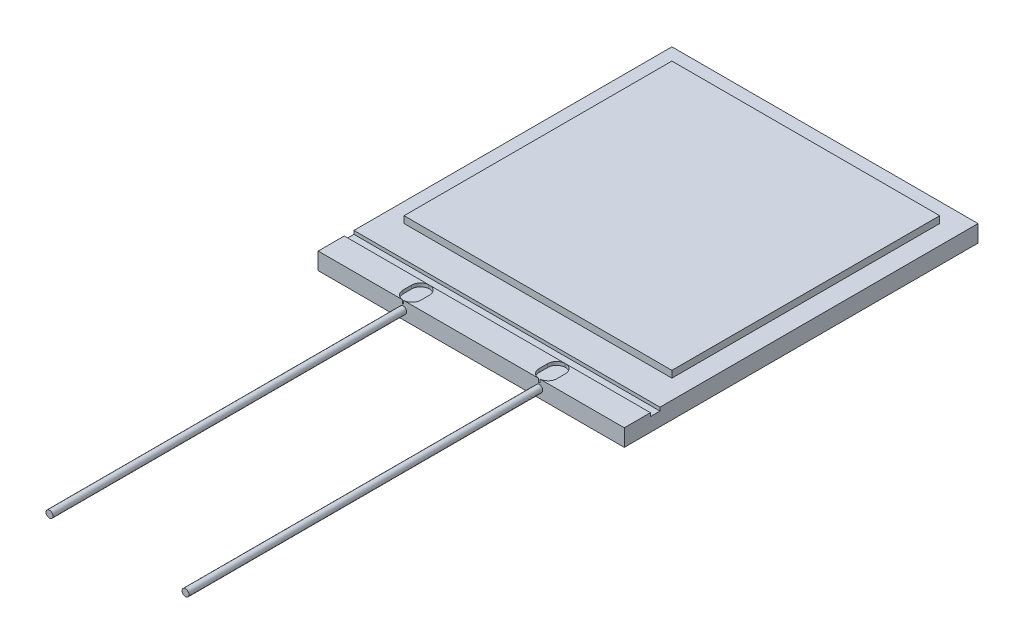
ISO-10303-21;
HEADER;
FILE_DESCRIPTION(('STEP AP214'),'2;1');
FILE_NAME('part.step','',(''),(''),'','','');
FILE_SCHEMA(('AUTOMOTIVE_DESIGN { 1 0 10303 214 1 1 1 1 }'));
ENDSEC;
DATA;
#1=APPLICATION_CONTEXT('core data for automotive mechanical design processes');
#2=APPLICATION_PROTOCOL_DEFINITION('international standard','automotive_design',2000,#1);
#3=PRODUCT_CONTEXT('',#1,'mechanical');
#4=PRODUCT('Part','Part','',(#3));
#5=PRODUCT_RELATED_PRODUCT_CATEGORY('part','',(#4));
#6=PRODUCT_DEFINITION_FORMATION('','',#4);
#7=PRODUCT_DEFINITION_CONTEXT('part definition',#1,'design');
#8=PRODUCT_DEFINITION('design','',#6,#7);
#9=PRODUCT_DEFINITION_SHAPE('','',#8);
#10=(LENGTH_UNIT() NAMED_UNIT(*) SI_UNIT(.MILLI.,.METRE.));
#11=(NAMED_UNIT(*) PLANE_ANGLE_UNIT() SI_UNIT($,.RADIAN.));
#12=(NAMED_UNIT(*) SI_UNIT($,.STERADIAN.) SOLID_ANGLE_UNIT());
#13=UNCERTAINTY_MEASURE_WITH_UNIT(LENGTH_MEASURE(1.E-05),#10,'distance_accuracy_value','');
#14=(GEOMETRIC_REPRESENTATION_CONTEXT(3) GLOBAL_UNCERTAINTY_ASSIGNED_CONTEXT((#13)) GLOBAL_UNIT_ASSIGNED_CONTEXT((#10,
#11,#12)) REPRESENTATION_CONTEXT('',''));
#15=CARTESIAN_POINT('',(0.,0.,0.));
#16=DIRECTION('',(0.,0.,1.));
#17=DIRECTION('',(1.,0.,0.));
#18=AXIS2_PLACEMENT_3D('',#15,#16,#17);
#19=CARTESIAN_POINT('',(5.715,0.635,6.604));
#20=DIRECTION('',(0.,0.,-1.));
#21=DIRECTION('',(-1.,0.,0.));
#22=AXIS2_PLACEMENT_3D('',#19,#20,#21);
#23=PLANE('',#22);
#24=DIRECTION('',(0.,1.,0.));
#25=VECTOR('',#24,1.);
#26=CARTESIAN_POINT('',(2.56024760363874,0.508,6.604));
#27=LINE('',#26,#25);
#28=CARTESIAN_POINT('',(2.56024760363874,0.508,6.604));
#29=VERTEX_POINT('',#28);
#30=CARTESIAN_POINT('',(2.56024760363874,0.635,6.604));
#31=VERTEX_POINT('',#30);
#32=EDGE_CURVE('E342',#29,#31,#27,.T.);
#33=ORIENTED_EDGE('',*,*,#32,.F.);
#34=DIRECTION('',(1.,0.,0.));
#35=VECTOR('',#34,1.);
#36=CARTESIAN_POINT('',(0.,0.508,6.604));
#37=LINE('',#36,#35);
#38=CARTESIAN_POINT('',(2.51975239636126,0.508,6.604));
#39=VERTEX_POINT('',#38);
#40=EDGE_CURVE('E692',#39,#29,#37,.T.);
#41=ORIENTED_EDGE('',*,*,#40,.F.);
#42=DIRECTION('',(0.,1.,0.));
#43=VECTOR('',#42,1.);
#44=CARTESIAN_POINT('',(2.51975239636126,0.508,6.604));
#45=LINE('',#44,#43);
#46=CARTESIAN_POINT('',(2.51975239636126,0.635,6.604));
#47=VERTEX_POINT('',#46);
#48=EDGE_CURVE('E359',#39,#47,#45,.T.);
#49=ORIENTED_EDGE('',*,*,#48,.T.);
#50=DIRECTION('',(1.,0.,0.));
#51=VECTOR('',#50,1.);
#52=CARTESIAN_POINT('',(5.715,0.635,6.604));
#53=LINE('',#52,#51);
#54=CARTESIAN_POINT('',(-2.51975239636126,0.635,6.604));
#55=VERTEX_POINT('',#54);
#56=EDGE_CURVE('E489',#55,#47,#53,.T.);
#57=ORIENTED_EDGE('',*,*,#56,.F.);
#58=DIRECTION('',(0.,1.,0.));
#59=VECTOR('',#58,1.);
#60=CARTESIAN_POINT('',(-2.51975239636126,0.508,6.604));
#61=LINE('',#60,#59);
#62=CARTESIAN_POINT('',(-2.51975239636126,0.508,6.604));
#63=VERTEX_POINT('',#62);
#64=EDGE_CURVE('E673',#63,#55,#61,.T.);
#65=ORIENTED_EDGE('',*,*,#64,.F.);
#66=DIRECTION('',(1.,0.,0.));
#67=VECTOR('',#66,1.);
#68=CARTESIAN_POINT('',(0.,0.508,6.604));
#69=LINE('',#68,#67);
#70=CARTESIAN_POINT('',(-2.56024760363874,0.508,6.604));
#71=VERTEX_POINT('',#70);
#72=EDGE_CURVE('E529',#71,#63,#69,.T.);
#73=ORIENTED_EDGE('',*,*,#72,.F.);
#74=DIRECTION('',(0.,1.,0.));
#75=VECTOR('',#74,1.);
#76=CARTESIAN_POINT('',(-2.56024760363874,0.508,6.604));
#77=LINE('',#76,#75);
#78=CARTESIAN_POINT('',(-2.56024760363874,0.635,6.604));
#79=VERTEX_POINT('',#78);
#80=EDGE_CURVE('E362',#71,#79,#77,.T.);
#81=ORIENTED_EDGE('',*,*,#80,.T.);
#82=CARTESIAN_POINT('',(-5.715,0.635,6.604));
#83=VERTEX_POINT('',#82);
#84=EDGE_CURVE('E485',#83,#79,#53,.T.);
#85=ORIENTED_EDGE('',*,*,#84,.F.);
#86=DIRECTION('',(0.,-1.,0.));
#87=VECTOR('',#86,1.);
#88=CARTESIAN_POINT('',(-5.715,0.635,6.604));
#89=LINE('',#88,#87);
#90=CARTESIAN_POINT('',(-5.715,0.,6.604));
#91=VERTEX_POINT('',#90);
#92=EDGE_CURVE('E503',#83,#91,#89,.T.);
#93=ORIENTED_EDGE('',*,*,#92,.T.);
#94=DIRECTION('',(1.,0.,0.));
#95=VECTOR('',#94,1.);
#96=CARTESIAN_POINT('',(5.715,0.,6.604));
#97=LINE('',#96,#95);
#98=CARTESIAN_POINT('',(5.715,0.,6.604));
#99=VERTEX_POINT('',#98);
#100=EDGE_CURVE('E500',#91,#99,#97,.T.);
#101=ORIENTED_EDGE('',*,*,#100,.T.);
#102=DIRECTION('',(0.,-1.,0.));
#103=VECTOR('',#102,1.);
#104=CARTESIAN_POINT('',(5.715,0.635,6.604));
#105=LINE('',#104,#103);
#106=CARTESIAN_POINT('',(5.715,0.635,6.604));
#107=VERTEX_POINT('',#106);
#108=EDGE_CURVE('E443',#107,#99,#105,.T.);
#109=ORIENTED_EDGE('',*,*,#108,.F.);
#110=EDGE_CURVE('E345',#31,#107,#53,.T.);
#111=ORIENTED_EDGE('',*,*,#110,.F.);
#112=EDGE_LOOP('',(#33,#41,#49,#57,#65,#73,#81,#85,#93,#101,#109,#111));
#113=FACE_BOUND('',#112,.T.);
#114=CARTESIAN_POINT('',(-2.54,0.3175,6.604));
#115=DIRECTION('',(0.,0.,-1.));
#116=DIRECTION('',(-1.,0.,0.));
#117=AXIS2_PLACEMENT_3D('',#114,#115,#116);
#118=CIRCLE('',#117,0.129854710524441);
#119=CARTESIAN_POINT('',(-2.66985471052444,0.3175,6.604));
#120=VERTEX_POINT('',#119);
#121=EDGE_CURVE('E152',#120,#120,#118,.F.);
#122=ORIENTED_EDGE('',*,*,#121,.F.);
#123=EDGE_LOOP('',(#122));
#124=FACE_BOUND('',#123,.T.);
#125=CARTESIAN_POINT('',(2.54,0.3175,6.604));
#126=DIRECTION('',(0.,0.,-1.));
#127=DIRECTION('',(-1.,0.,0.));
#128=AXIS2_PLACEMENT_3D('',#125,#126,#127);
#129=CIRCLE('',#128,0.129854710524441);
#130=CARTESIAN_POINT('',(2.41014528947556,0.3175,6.604));
#131=VERTEX_POINT('',#130);
#132=EDGE_CURVE('E13',#131,#131,#129,.F.);
#133=ORIENTED_EDGE('',*,*,#132,.F.);
#134=EDGE_LOOP('',(#133));
#135=FACE_BOUND('',#134,.T.);
#136=ADVANCED_FACE('F143',(#113,#124,#135),#23,.F.);
#137=CARTESIAN_POINT('',(-5.715,0.635,-6.604));
#138=DIRECTION('',(0.,1.,0.));
#139=DIRECTION('',(0.,0.,1.));
#140=AXIS2_PLACEMENT_3D('',#137,#138,#139);
#141=PLANE('',#140);
#142=DIRECTION('',(1.,0.,0.));
#143=VECTOR('',#142,1.);
#144=CARTESIAN_POINT('',(0.,0.635,5.62864));
#145=LINE('',#144,#143);
#146=CARTESIAN_POINT('',(2.56511819770642,0.635,5.62864));
#147=VERTEX_POINT('',#146);
#148=CARTESIAN_POINT('',(5.715,0.635,5.62864));
#149=VERTEX_POINT('',#148);
#150=EDGE_CURVE('E381',#147,#149,#145,.T.);
#151=ORIENTED_EDGE('',*,*,#150,.F.);
#152=CARTESIAN_POINT('',(2.54,0.635,5.95788324768168));
#153=DIRECTION('',(0.,1.,0.));
#154=DIRECTION('',(0.,0.,1.));
#155=AXIS2_PLACEMENT_3D('',#152,#153,#154);
#156=CIRCLE('',#155,0.3302);
#157=CARTESIAN_POINT('',(2.8702,0.635,5.95788324768168));
#158=VERTEX_POINT('',#157);
#159=EDGE_CURVE('E346',#147,#158,#156,.F.);
#160=ORIENTED_EDGE('',*,*,#159,.T.);
#161=DIRECTION('',(0.,0.,-1.));
#162=VECTOR('',#161,1.);
#163=CARTESIAN_POINT('',(2.8702,0.635,0.));
#164=LINE('',#163,#162);
#165=CARTESIAN_POINT('',(2.8702,0.635,6.27442136818827));
#166=VERTEX_POINT('',#165);
#167=EDGE_CURVE('E330',#166,#158,#164,.T.);
#168=ORIENTED_EDGE('',*,*,#167,.F.);
#169=CARTESIAN_POINT('',(2.54,0.635,6.27442136818827));
#170=DIRECTION('',(0.,1.,0.));
#171=DIRECTION('',(0.,0.,1.));
#172=AXIS2_PLACEMENT_3D('',#169,#170,#171);
#173=CIRCLE('',#172,0.3302);
#174=EDGE_CURVE('E339',#166,#31,#173,.F.);
#175=ORIENTED_EDGE('',*,*,#174,.T.);
#176=ORIENTED_EDGE('',*,*,#110,.T.);
#177=DIRECTION('',(0.,0.,-1.));
#178=VECTOR('',#177,1.);
#179=CARTESIAN_POINT('',(5.715,0.635,6.604));
#180=LINE('',#179,#178);
#181=EDGE_CURVE('E490',#107,#149,#180,.T.);
#182=ORIENTED_EDGE('',*,*,#181,.T.);
#183=EDGE_LOOP('',(#151,#160,#168,#175,#176,#182));
#184=FACE_BOUND('',#183,.T.);
#185=ADVANCED_FACE('F350',(#184),#141,.T.);
#186=DIRECTION('',(0.,0.,-1.));
#187=VECTOR('',#186,1.);
#188=CARTESIAN_POINT('',(2.2098,0.635,0.));
#189=LINE('',#188,#187);
#190=CARTESIAN_POINT('',(2.2098,0.635,6.27442136818827));
#191=VERTEX_POINT('',#190);
#192=CARTESIAN_POINT('',(2.2098,0.635,5.95788324768168));
#193=VERTEX_POINT('',#192);
#194=EDGE_CURVE('E493',#191,#193,#189,.T.);
#195=ORIENTED_EDGE('',*,*,#194,.T.);
#196=CARTESIAN_POINT('',(2.51488180229358,0.635,5.62864));
#197=VERTEX_POINT('',#196);
#198=EDGE_CURVE('E546',#193,#197,#156,.F.);
#199=ORIENTED_EDGE('',*,*,#198,.T.);
#200=CARTESIAN_POINT('',(-2.51488180229357,0.635,5.62864));
#201=VERTEX_POINT('',#200);
#202=EDGE_CURVE('E392',#201,#197,#145,.T.);
#203=ORIENTED_EDGE('',*,*,#202,.F.);
#204=CARTESIAN_POINT('',(-2.54,0.635,5.95788324768168));
#205=DIRECTION('',(0.,1.,0.));
#206=DIRECTION('',(0.,0.,1.));
#207=AXIS2_PLACEMENT_3D('',#204,#205,#206);
#208=CIRCLE('',#207,0.3302);
#209=CARTESIAN_POINT('',(-2.2098,0.635,5.95788324768168));
#210=VERTEX_POINT('',#209);
#211=EDGE_CURVE('E390',#210,#201,#208,.T.);
#212=ORIENTED_EDGE('',*,*,#211,.F.);
#213=DIRECTION('',(0.,0.,-1.));
#214=VECTOR('',#213,1.);
#215=CARTESIAN_POINT('',(-2.2098,0.635,0.));
#216=LINE('',#215,#214);
#217=CARTESIAN_POINT('',(-2.2098,0.635,6.27442136818827));
#218=VERTEX_POINT('',#217);
#219=EDGE_CURVE('E516',#218,#210,#216,.T.);
#220=ORIENTED_EDGE('',*,*,#219,.F.);
#221=CARTESIAN_POINT('',(-2.54,0.635,6.27442136818827));
#222=DIRECTION('',(0.,1.,0.));
#223=DIRECTION('',(0.,0.,1.));
#224=AXIS2_PLACEMENT_3D('',#221,#222,#223);
#225=CIRCLE('',#224,0.3302);
#226=EDGE_CURVE('E675',#55,#218,#225,.T.);
#227=ORIENTED_EDGE('',*,*,#226,.F.);
#228=ORIENTED_EDGE('',*,*,#56,.T.);
#229=EDGE_CURVE('E348',#47,#191,#173,.F.);
#230=ORIENTED_EDGE('',*,*,#229,.T.);
#231=EDGE_LOOP('',(#195,#199,#203,#212,#220,#227,#228,#230));
#232=FACE_BOUND('',#231,.T.);
#233=ADVANCED_FACE('F558',(#232),#141,.T.);
#234=CARTESIAN_POINT('',(-2.8702,0.635,6.27442136818827));
#235=VERTEX_POINT('',#234);
#236=EDGE_CURVE('E614',#235,#79,#225,.T.);
#237=ORIENTED_EDGE('',*,*,#236,.F.);
#238=DIRECTION('',(0.,0.,-1.));
#239=VECTOR('',#238,1.);
#240=CARTESIAN_POINT('',(-2.8702,0.635,0.));
#241=LINE('',#240,#239);
#242=CARTESIAN_POINT('',(-2.8702,0.635,5.95788324768168));
#243=VERTEX_POINT('',#242);
#244=EDGE_CURVE('E502',#235,#243,#241,.T.);
#245=ORIENTED_EDGE('',*,*,#244,.T.);
#246=CARTESIAN_POINT('',(-2.56511819770643,0.635,5.62864));
#247=VERTEX_POINT('',#246);
#248=EDGE_CURVE('E391',#247,#243,#208,.T.);
#249=ORIENTED_EDGE('',*,*,#248,.F.);
#250=CARTESIAN_POINT('',(-5.715,0.635,5.62864));
#251=VERTEX_POINT('',#250);
#252=EDGE_CURVE('E395',#251,#247,#145,.T.);
#253=ORIENTED_EDGE('',*,*,#252,.F.);
#254=DIRECTION('',(0.,0.,1.));
#255=VECTOR('',#254,1.);
#256=CARTESIAN_POINT('',(-5.715,0.635,6.604));
#257=LINE('',#256,#255);
#258=EDGE_CURVE('E486',#251,#83,#257,.T.);
#259=ORIENTED_EDGE('',*,*,#258,.T.);
#260=ORIENTED_EDGE('',*,*,#84,.T.);
#261=EDGE_LOOP('',(#237,#245,#249,#253,#259,#260));
#262=FACE_BOUND('',#261,.T.);
#263=ADVANCED_FACE('F612',(#262),#141,.T.);
#264=DIRECTION('',(1.,0.,0.));
#265=VECTOR('',#264,1.);
#266=CARTESIAN_POINT('',(5.0000027,0.635,4.1110027));
#267=LINE('',#266,#265);
#268=CARTESIAN_POINT('',(-5.0000027,0.635,4.1110027));
#269=VERTEX_POINT('',#268);
#270=CARTESIAN_POINT('',(5.0000027,0.635,4.1110027));
#271=VERTEX_POINT('',#270);
#272=EDGE_CURVE('E466',#269,#271,#267,.T.);
#273=ORIENTED_EDGE('',*,*,#272,.F.);
#274=DIRECTION('',(0.,0.,1.));
#275=VECTOR('',#274,1.);
#276=CARTESIAN_POINT('',(-5.0000027,0.635,4.1110027));
#277=LINE('',#276,#275);
#278=CARTESIAN_POINT('',(-5.0000027,0.635,-5.8890027));
#279=VERTEX_POINT('',#278);
#280=EDGE_CURVE('E461',#279,#269,#277,.T.);
#281=ORIENTED_EDGE('',*,*,#280,.F.);
#282=DIRECTION('',(-1.,0.,0.));
#283=VECTOR('',#282,1.);
#284=CARTESIAN_POINT('',(5.0000027,0.635,-5.8890027));
#285=LINE('',#284,#283);
#286=CARTESIAN_POINT('',(5.0000027,0.635,-5.8890027));
#287=VERTEX_POINT('',#286);
#288=EDGE_CURVE('E473',#287,#279,#285,.T.);
#289=ORIENTED_EDGE('',*,*,#288,.F.);
#290=DIRECTION('',(0.,0.,-1.));
#291=VECTOR('',#290,1.);
#292=CARTESIAN_POINT('',(5.0000027,0.635,4.1110027));
#293=LINE('',#292,#291);
#294=EDGE_CURVE('E469',#271,#287,#293,.T.);
#295=ORIENTED_EDGE('',*,*,#294,.F.);
#296=EDGE_LOOP('',(#273,#281,#289,#295));
#297=FACE_BOUND('',#296,.T.);
#298=CARTESIAN_POINT('',(-5.715,0.635,-6.604));
#299=VERTEX_POINT('',#298);
#300=CARTESIAN_POINT('',(-5.715,0.635,5.2705));
#301=VERTEX_POINT('',#300);
#302=EDGE_CURVE('E482',#299,#301,#257,.T.);
#303=ORIENTED_EDGE('',*,*,#302,.T.);
#304=DIRECTION('',(1.,0.,0.));
#305=VECTOR('',#304,1.);
#306=CARTESIAN_POINT('',(0.,0.635,5.2705));
#307=LINE('',#306,#305);
#308=CARTESIAN_POINT('',(5.715,0.635,5.2705));
#309=VERTEX_POINT('',#308);
#310=EDGE_CURVE('E407',#301,#309,#307,.T.);
#311=ORIENTED_EDGE('',*,*,#310,.T.);
#312=CARTESIAN_POINT('',(5.715,0.635,-6.604));
#313=VERTEX_POINT('',#312);
#314=EDGE_CURVE('E494',#309,#313,#180,.T.);
#315=ORIENTED_EDGE('',*,*,#314,.T.);
#316=DIRECTION('',(-1.,0.,0.));
#317=VECTOR('',#316,1.);
#318=CARTESIAN_POINT('',(5.715,0.635,-6.604));
#319=LINE('',#318,#317);
#320=EDGE_CURVE('E444',#313,#299,#319,.T.);
#321=ORIENTED_EDGE('',*,*,#320,.T.);
#322=EDGE_LOOP('',(#303,#311,#315,#321));
#323=FACE_BOUND('',#322,.T.);
#324=ADVANCED_FACE('F587',(#297,#323),#141,.T.);
#325=CARTESIAN_POINT('',(5.715,0.635,6.604));
#326=DIRECTION('',(-1.,0.,0.));
#327=DIRECTION('',(0.,0.,1.));
#328=AXIS2_PLACEMENT_3D('',#325,#326,#327);
#329=PLANE('',#328);
#330=DIRECTION('',(0.,1.,0.));
#331=VECTOR('',#330,1.);
#332=CARTESIAN_POINT('',(5.715,0.508,5.2705));
#333=LINE('',#332,#331);
#334=CARTESIAN_POINT('',(5.715,0.508,5.2705));
#335=VERTEX_POINT('',#334);
#336=EDGE_CURVE('E413',#335,#309,#333,.T.);
#337=ORIENTED_EDGE('',*,*,#336,.F.);
#338=DIRECTION('',(0.,0.,-1.));
#339=VECTOR('',#338,1.);
#340=CARTESIAN_POINT('',(5.715,0.508,0.));
#341=LINE('',#340,#339);
#342=CARTESIAN_POINT('',(5.715,0.508,5.62864));
#343=VERTEX_POINT('',#342);
#344=EDGE_CURVE('E417',#343,#335,#341,.T.);
#345=ORIENTED_EDGE('',*,*,#344,.F.);
#346=DIRECTION('',(0.,1.,0.));
#347=VECTOR('',#346,1.);
#348=CARTESIAN_POINT('',(5.715,0.508,5.62864));
#349=LINE('',#348,#347);
#350=EDGE_CURVE('E441',#343,#149,#349,.T.);
#351=ORIENTED_EDGE('',*,*,#350,.T.);
#352=ORIENTED_EDGE('',*,*,#181,.F.);
#353=ORIENTED_EDGE('',*,*,#108,.T.);
#354=DIRECTION('',(0.,0.,-1.));
#355=VECTOR('',#354,1.);
#356=CARTESIAN_POINT('',(5.715,0.,6.604));
#357=LINE('',#356,#355);
#358=CARTESIAN_POINT('',(5.715,0.,-6.604));
#359=VERTEX_POINT('',#358);
#360=EDGE_CURVE('E439',#99,#359,#357,.T.);
#361=ORIENTED_EDGE('',*,*,#360,.T.);
#362=DIRECTION('',(0.,-1.,0.));
#363=VECTOR('',#362,1.);
#364=CARTESIAN_POINT('',(5.715,0.635,-6.604));
#365=LINE('',#364,#363);
#366=EDGE_CURVE('E465',#313,#359,#365,.T.);
#367=ORIENTED_EDGE('',*,*,#366,.F.);
#368=ORIENTED_EDGE('',*,*,#314,.F.);
#369=EDGE_LOOP('',(#337,#345,#351,#352,#353,#361,#367,#368));
#370=FACE_BOUND('',#369,.T.);
#371=ADVANCED_FACE('F590',(#370),#329,.F.);
#372=CARTESIAN_POINT('',(-5.715,0.635,6.604));
#373=DIRECTION('',(1.,0.,0.));
#374=DIRECTION('',(0.,0.,-1.));
#375=AXIS2_PLACEMENT_3D('',#372,#373,#374);
#376=PLANE('',#375);
#377=ORIENTED_EDGE('',*,*,#258,.F.);
#378=DIRECTION('',(0.,1.,0.));
#379=VECTOR('',#378,1.);
#380=CARTESIAN_POINT('',(-5.715,0.508,5.62864));
#381=LINE('',#380,#379);
#382=CARTESIAN_POINT('',(-5.715,0.508,5.62864));
#383=VERTEX_POINT('',#382);
#384=EDGE_CURVE('E398',#383,#251,#381,.T.);
#385=ORIENTED_EDGE('',*,*,#384,.F.);
#386=DIRECTION('',(0.,0.,1.));
#387=VECTOR('',#386,1.);
#388=CARTESIAN_POINT('',(-5.715,0.508,0.));
#389=LINE('',#388,#387);
#390=CARTESIAN_POINT('',(-5.715,0.508,5.2705));
#391=VERTEX_POINT('',#390);
#392=EDGE_CURVE('E405',#391,#383,#389,.T.);
#393=ORIENTED_EDGE('',*,*,#392,.F.);
#394=DIRECTION('',(0.,1.,0.));
#395=VECTOR('',#394,1.);
#396=CARTESIAN_POINT('',(-5.715,0.508,5.2705));
#397=LINE('',#396,#395);
#398=EDGE_CURVE('E436',#391,#301,#397,.T.);
#399=ORIENTED_EDGE('',*,*,#398,.T.);
#400=ORIENTED_EDGE('',*,*,#302,.F.);
#401=DIRECTION('',(0.,-1.,0.));
#402=VECTOR('',#401,1.);
#403=CARTESIAN_POINT('',(-5.715,0.635,-6.604));
#404=LINE('',#403,#402);
#405=CARTESIAN_POINT('',(-5.715,0.,-6.604));
#406=VERTEX_POINT('',#405);
#407=EDGE_CURVE('E438',#299,#406,#404,.T.);
#408=ORIENTED_EDGE('',*,*,#407,.T.);
#409=DIRECTION('',(0.,0.,1.));
#410=VECTOR('',#409,1.);
#411=CARTESIAN_POINT('',(-5.715,0.,6.604));
#412=LINE('',#411,#410);
#413=EDGE_CURVE('E496',#406,#91,#412,.T.);
#414=ORIENTED_EDGE('',*,*,#413,.T.);
#415=ORIENTED_EDGE('',*,*,#92,.F.);
#416=EDGE_LOOP('',(#377,#385,#393,#399,#400,#408,#414,#415));
#417=FACE_BOUND('',#416,.T.);
#418=ADVANCED_FACE('F592',(#417),#376,.F.);
#419=CARTESIAN_POINT('',(5.715,0.635,-6.604));
#420=DIRECTION('',(0.,0.,1.));
#421=DIRECTION('',(1.,0.,0.));
#422=AXIS2_PLACEMENT_3D('',#419,#420,#421);
#423=PLANE('',#422);
#424=DIRECTION('',(-1.,0.,0.));
#425=VECTOR('',#424,1.);
#426=CARTESIAN_POINT('',(5.715,0.,-6.604));
#427=LINE('',#426,#425);
#428=EDGE_CURVE('E499',#359,#406,#427,.T.);
#429=ORIENTED_EDGE('',*,*,#428,.T.);
#430=ORIENTED_EDGE('',*,*,#407,.F.);
#431=ORIENTED_EDGE('',*,*,#320,.F.);
#432=ORIENTED_EDGE('',*,*,#366,.T.);
#433=EDGE_LOOP('',(#429,#430,#431,#432));
#434=FACE_BOUND('',#433,.T.);
#435=ADVANCED_FACE('F594',(#434),#423,.F.);
#436=CARTESIAN_POINT('',(-5.715,0.,-6.604));
#437=DIRECTION('',(0.,1.,0.));
#438=DIRECTION('',(0.,0.,1.));
#439=AXIS2_PLACEMENT_3D('',#436,#437,#438);
#440=PLANE('',#439);
#441=ORIENTED_EDGE('',*,*,#413,.F.);
#442=ORIENTED_EDGE('',*,*,#428,.F.);
#443=ORIENTED_EDGE('',*,*,#360,.F.);
#444=ORIENTED_EDGE('',*,*,#100,.F.);
#445=EDGE_LOOP('',(#441,#442,#443,#444));
#446=FACE_BOUND('',#445,.T.);
#447=ADVANCED_FACE('F600',(#446),#440,.F.);
#448=CARTESIAN_POINT('',(-5.0000027,0.889,4.1110027));
#449=DIRECTION('',(1.,0.,0.));
#450=DIRECTION('',(0.,0.,-1.));
#451=AXIS2_PLACEMENT_3D('',#448,#449,#450);
#452=PLANE('',#451);
#453=ORIENTED_EDGE('',*,*,#280,.T.);
#454=DIRECTION('',(0.,-1.,0.));
#455=VECTOR('',#454,1.);
#456=CARTESIAN_POINT('',(-5.0000027,0.889,4.1110027));
#457=LINE('',#456,#455);
#458=CARTESIAN_POINT('',(-5.0000027,0.889,4.1110027));
#459=VERTEX_POINT('',#458);
#460=EDGE_CURVE('E468',#459,#269,#457,.T.);
#461=ORIENTED_EDGE('',*,*,#460,.F.);
#462=DIRECTION('',(0.,0.,1.));
#463=VECTOR('',#462,1.);
#464=CARTESIAN_POINT('',(-5.0000027,0.889,4.1110027));
#465=LINE('',#464,#463);
#466=CARTESIAN_POINT('',(-5.0000027,0.889,-5.8890027));
#467=VERTEX_POINT('',#466);
#468=EDGE_CURVE('E418',#467,#459,#465,.T.);
#469=ORIENTED_EDGE('',*,*,#468,.F.);
#470=DIRECTION('',(0.,-1.,0.));
#471=VECTOR('',#470,1.);
#472=CARTESIAN_POINT('',(-5.0000027,0.889,-5.8890027));
#473=LINE('',#472,#471);
#474=EDGE_CURVE('E464',#467,#279,#473,.T.);
#475=ORIENTED_EDGE('',*,*,#474,.T.);
#476=EDGE_LOOP('',(#453,#461,#469,#475));
#477=FACE_BOUND('',#476,.T.);
#478=ADVANCED_FACE('F778',(#477),#452,.F.);
#479=CARTESIAN_POINT('',(5.0000027,0.889,4.1110027));
#480=DIRECTION('',(0.,0.,-1.));
#481=DIRECTION('',(-1.,0.,0.));
#482=AXIS2_PLACEMENT_3D('',#479,#480,#481);
#483=PLANE('',#482);
#484=ORIENTED_EDGE('',*,*,#272,.T.);
#485=DIRECTION('',(0.,-1.,0.));
#486=VECTOR('',#485,1.);
#487=CARTESIAN_POINT('',(5.0000027,0.889,4.1110027));
#488=LINE('',#487,#486);
#489=CARTESIAN_POINT('',(5.0000027,0.889,4.1110027));
#490=VERTEX_POINT('',#489);
#491=EDGE_CURVE('E472',#490,#271,#488,.T.);
#492=ORIENTED_EDGE('',*,*,#491,.F.);
#493=DIRECTION('',(1.,0.,0.));
#494=VECTOR('',#493,1.);
#495=CARTESIAN_POINT('',(5.0000027,0.889,4.1110027));
#496=LINE('',#495,#494);
#497=EDGE_CURVE('E458',#459,#490,#496,.T.);
#498=ORIENTED_EDGE('',*,*,#497,.F.);
#499=ORIENTED_EDGE('',*,*,#460,.T.);
#500=EDGE_LOOP('',(#484,#492,#498,#499));
#501=FACE_BOUND('',#500,.T.);
#502=ADVANCED_FACE('F768',(#501),#483,.F.);
#503=CARTESIAN_POINT('',(5.0000027,0.889,4.1110027));
#504=DIRECTION('',(-1.,0.,0.));
#505=DIRECTION('',(0.,0.,1.));
#506=AXIS2_PLACEMENT_3D('',#503,#504,#505);
#507=PLANE('',#506);
#508=ORIENTED_EDGE('',*,*,#294,.T.);
#509=DIRECTION('',(0.,-1.,0.));
#510=VECTOR('',#509,1.);
#511=CARTESIAN_POINT('',(5.0000027,0.889,-5.8890027));
#512=LINE('',#511,#510);
#513=CARTESIAN_POINT('',(5.0000027,0.889,-5.8890027));
#514=VERTEX_POINT('',#513);
#515=EDGE_CURVE('E475',#514,#287,#512,.T.);
#516=ORIENTED_EDGE('',*,*,#515,.F.);
#517=DIRECTION('',(0.,0.,-1.));
#518=VECTOR('',#517,1.);
#519=CARTESIAN_POINT('',(5.0000027,0.889,4.1110027));
#520=LINE('',#519,#518);
#521=EDGE_CURVE('E452',#490,#514,#520,.T.);
#522=ORIENTED_EDGE('',*,*,#521,.F.);
#523=ORIENTED_EDGE('',*,*,#491,.T.);
#524=EDGE_LOOP('',(#508,#516,#522,#523));
#525=FACE_BOUND('',#524,.T.);
#526=ADVANCED_FACE('F758',(#525),#507,.F.);
#527=CARTESIAN_POINT('',(5.0000027,0.889,-5.8890027));
#528=DIRECTION('',(0.,0.,1.));
#529=DIRECTION('',(1.,0.,0.));
#530=AXIS2_PLACEMENT_3D('',#527,#528,#529);
#531=PLANE('',#530);
#532=ORIENTED_EDGE('',*,*,#288,.T.);
#533=ORIENTED_EDGE('',*,*,#474,.F.);
#534=DIRECTION('',(-1.,0.,0.));
#535=VECTOR('',#534,1.);
#536=CARTESIAN_POINT('',(5.0000027,0.889,-5.8890027));
#537=LINE('',#536,#535);
#538=EDGE_CURVE('E450',#514,#467,#537,.T.);
#539=ORIENTED_EDGE('',*,*,#538,.F.);
#540=ORIENTED_EDGE('',*,*,#515,.T.);
#541=EDGE_LOOP('',(#532,#533,#539,#540));
#542=FACE_BOUND('',#541,.T.);
#543=ADVANCED_FACE('F749',(#542),#531,.F.);
#544=CARTESIAN_POINT('',(-5.0000027,0.889,-5.8890027));
#545=DIRECTION('',(0.,1.,0.));
#546=DIRECTION('',(0.,0.,1.));
#547=AXIS2_PLACEMENT_3D('',#544,#545,#546);
#548=PLANE('',#547);
#549=ORIENTED_EDGE('',*,*,#468,.T.);
#550=ORIENTED_EDGE('',*,*,#497,.T.);
#551=ORIENTED_EDGE('',*,*,#521,.T.);
#552=ORIENTED_EDGE('',*,*,#538,.T.);
#553=EDGE_LOOP('',(#549,#550,#551,#552));
#554=FACE_BOUND('',#553,.T.);
#555=ADVANCED_FACE('F636',(#554),#548,.T.);
#556=CARTESIAN_POINT('',(0.,0.508,5.62864));
#557=DIRECTION('',(0.,0.,1.));
#558=DIRECTION('',(1.,0.,0.));
#559=AXIS2_PLACEMENT_3D('',#556,#557,#558);
#560=PLANE('',#559);
#561=ORIENTED_EDGE('',*,*,#202,.T.);
#562=DIRECTION('',(0.,1.,0.));
#563=VECTOR('',#562,1.);
#564=CARTESIAN_POINT('',(2.51488180229358,0.508,5.62864));
#565=LINE('',#564,#563);
#566=CARTESIAN_POINT('',(2.51488180229358,0.508,5.62864));
#567=VERTEX_POINT('',#566);
#568=EDGE_CURVE('E159',#567,#197,#565,.T.);
#569=ORIENTED_EDGE('',*,*,#568,.F.);
#570=DIRECTION('',(1.,0.,0.));
#571=VECTOR('',#570,1.);
#572=CARTESIAN_POINT('',(0.,0.508,5.62864));
#573=LINE('',#572,#571);
#574=CARTESIAN_POINT('',(-2.51488180229357,0.508,5.62864));
#575=VERTEX_POINT('',#574);
#576=EDGE_CURVE('E380',#575,#567,#573,.T.);
#577=ORIENTED_EDGE('',*,*,#576,.F.);
#578=DIRECTION('',(0.,1.,0.));
#579=VECTOR('',#578,1.);
#580=CARTESIAN_POINT('',(-2.51488180229357,0.508,5.62864));
#581=LINE('',#580,#579);
#582=EDGE_CURVE('E399',#575,#201,#581,.T.);
#583=ORIENTED_EDGE('',*,*,#582,.T.);
#584=EDGE_LOOP('',(#561,#569,#577,#583));
#585=FACE_BOUND('',#584,.T.);
#586=ADVANCED_FACE('F628',(#585),#560,.F.);
#587=ORIENTED_EDGE('',*,*,#252,.T.);
#588=DIRECTION('',(0.,1.,0.));
#589=VECTOR('',#588,1.);
#590=CARTESIAN_POINT('',(-2.56511819770643,0.508,5.62864));
#591=LINE('',#590,#589);
#592=CARTESIAN_POINT('',(-2.56511819770643,0.508,5.62864));
#593=VERTEX_POINT('',#592);
#594=EDGE_CURVE('E387',#593,#247,#591,.T.);
#595=ORIENTED_EDGE('',*,*,#594,.F.);
#596=EDGE_CURVE('E414',#383,#593,#573,.T.);
#597=ORIENTED_EDGE('',*,*,#596,.F.);
#598=ORIENTED_EDGE('',*,*,#384,.T.);
#599=EDGE_LOOP('',(#587,#595,#597,#598));
#600=FACE_BOUND('',#599,.T.);
#601=ADVANCED_FACE('F625',(#600),#560,.F.);
#602=CARTESIAN_POINT('',(0.,0.508,5.2705));
#603=DIRECTION('',(0.,0.,1.));
#604=DIRECTION('',(1.,0.,0.));
#605=AXIS2_PLACEMENT_3D('',#602,#603,#604);
#606=PLANE('',#605);
#607=ORIENTED_EDGE('',*,*,#310,.F.);
#608=ORIENTED_EDGE('',*,*,#398,.F.);
#609=DIRECTION('',(1.,0.,0.));
#610=VECTOR('',#609,1.);
#611=CARTESIAN_POINT('',(0.,0.508,5.2705));
#612=LINE('',#611,#610);
#613=EDGE_CURVE('E428',#391,#335,#612,.T.);
#614=ORIENTED_EDGE('',*,*,#613,.T.);
#615=ORIENTED_EDGE('',*,*,#336,.T.);
#616=EDGE_LOOP('',(#607,#608,#614,#615));
#617=FACE_BOUND('',#616,.T.);
#618=ADVANCED_FACE('F627',(#617),#606,.T.);
#619=ORIENTED_EDGE('',*,*,#150,.T.);
#620=ORIENTED_EDGE('',*,*,#350,.F.);
#621=CARTESIAN_POINT('',(2.56511819770642,0.508,5.62864));
#622=VERTEX_POINT('',#621);
#623=EDGE_CURVE('E415',#622,#343,#573,.T.);
#624=ORIENTED_EDGE('',*,*,#623,.F.);
#625=DIRECTION('',(0.,1.,0.));
#626=VECTOR('',#625,1.);
#627=CARTESIAN_POINT('',(2.56511819770642,0.508,5.62864));
#628=LINE('',#627,#626);
#629=EDGE_CURVE('E377',#622,#147,#628,.T.);
#630=ORIENTED_EDGE('',*,*,#629,.T.);
#631=EDGE_LOOP('',(#619,#620,#624,#630));
#632=FACE_BOUND('',#631,.T.);
#633=ADVANCED_FACE('F630',(#632),#560,.F.);
#634=CARTESIAN_POINT('',(0.,0.508,0.));
#635=DIRECTION('',(0.,1.,0.));
#636=DIRECTION('',(0.,0.,1.));
#637=AXIS2_PLACEMENT_3D('',#634,#635,#636);
#638=PLANE('',#637);
#639=ORIENTED_EDGE('',*,*,#576,.T.);
#640=CARTESIAN_POINT('',(2.54,0.508,5.95788324768168));
#641=DIRECTION('',(0.,1.,0.));
#642=DIRECTION('',(0.,0.,1.));
#643=AXIS2_PLACEMENT_3D('',#640,#641,#642);
#644=CIRCLE('',#643,0.3302);
#645=CARTESIAN_POINT('',(2.2098,0.508,5.95788324768168));
#646=VERTEX_POINT('',#645);
#647=EDGE_CURVE('E357',#646,#567,#644,.F.);
#648=ORIENTED_EDGE('',*,*,#647,.F.);
#649=DIRECTION('',(0.,0.,-1.));
#650=VECTOR('',#649,1.);
#651=CARTESIAN_POINT('',(2.2098,0.508,0.));
#652=LINE('',#651,#650);
#653=CARTESIAN_POINT('',(2.2098,0.508,6.27442136818827));
#654=VERTEX_POINT('',#653);
#655=EDGE_CURVE('E368',#654,#646,#652,.T.);
#656=ORIENTED_EDGE('',*,*,#655,.F.);
#657=CARTESIAN_POINT('',(2.54,0.508,6.27442136818827));
#658=DIRECTION('',(0.,1.,0.));
#659=DIRECTION('',(0.,0.,1.));
#660=AXIS2_PLACEMENT_3D('',#657,#658,#659);
#661=CIRCLE('',#660,0.3302);
#662=EDGE_CURVE('E365',#39,#654,#661,.F.);
#663=ORIENTED_EDGE('',*,*,#662,.F.);
#664=ORIENTED_EDGE('',*,*,#40,.T.);
#665=CARTESIAN_POINT('',(2.8702,0.508,6.27442136818827));
#666=VERTEX_POINT('',#665);
#667=EDGE_CURVE('E352',#666,#29,#661,.F.);
#668=ORIENTED_EDGE('',*,*,#667,.F.);
#669=DIRECTION('',(0.,0.,-1.));
#670=VECTOR('',#669,1.);
#671=CARTESIAN_POINT('',(2.8702,0.508,0.));
#672=LINE('',#671,#670);
#673=CARTESIAN_POINT('',(2.8702,0.508,5.95788324768168));
#674=VERTEX_POINT('',#673);
#675=EDGE_CURVE('E333',#666,#674,#672,.T.);
#676=ORIENTED_EDGE('',*,*,#675,.T.);
#677=EDGE_CURVE('E336',#622,#674,#644,.F.);
#678=ORIENTED_EDGE('',*,*,#677,.F.);
#679=ORIENTED_EDGE('',*,*,#623,.T.);
#680=ORIENTED_EDGE('',*,*,#344,.T.);
#681=ORIENTED_EDGE('',*,*,#613,.F.);
#682=ORIENTED_EDGE('',*,*,#392,.T.);
#683=ORIENTED_EDGE('',*,*,#596,.T.);
#684=CARTESIAN_POINT('',(-2.54,0.508,5.95788324768168));
#685=DIRECTION('',(0.,1.,0.));
#686=DIRECTION('',(0.,0.,1.));
#687=AXIS2_PLACEMENT_3D('',#684,#685,#686);
#688=CIRCLE('',#687,0.3302);
#689=CARTESIAN_POINT('',(-2.8702,0.508,5.95788324768168));
#690=VERTEX_POINT('',#689);
#691=EDGE_CURVE('E517',#593,#690,#688,.T.);
#692=ORIENTED_EDGE('',*,*,#691,.T.);
#693=DIRECTION('',(0.,0.,-1.));
#694=VECTOR('',#693,1.);
#695=CARTESIAN_POINT('',(-2.8702,0.508,0.));
#696=LINE('',#695,#694);
#697=CARTESIAN_POINT('',(-2.8702,0.508,6.27442136818827));
#698=VERTEX_POINT('',#697);
#699=EDGE_CURVE('E521',#698,#690,#696,.T.);
#700=ORIENTED_EDGE('',*,*,#699,.F.);
#701=CARTESIAN_POINT('',(-2.54,0.508,6.27442136818827));
#702=DIRECTION('',(0.,1.,0.));
#703=DIRECTION('',(0.,0.,1.));
#704=AXIS2_PLACEMENT_3D('',#701,#702,#703);
#705=CIRCLE('',#704,0.3302);
#706=EDGE_CURVE('E526',#698,#71,#705,.T.);
#707=ORIENTED_EDGE('',*,*,#706,.T.);
#708=ORIENTED_EDGE('',*,*,#72,.T.);
#709=CARTESIAN_POINT('',(-2.2098,0.508,6.27442136818827));
#710=VERTEX_POINT('',#709);
#711=EDGE_CURVE('E530',#63,#710,#705,.T.);
#712=ORIENTED_EDGE('',*,*,#711,.T.);
#713=DIRECTION('',(0.,0.,-1.));
#714=VECTOR('',#713,1.);
#715=CARTESIAN_POINT('',(-2.2098,0.508,0.));
#716=LINE('',#715,#714);
#717=CARTESIAN_POINT('',(-2.2098,0.508,5.95788324768168));
#718=VERTEX_POINT('',#717);
#719=EDGE_CURVE('E423',#710,#718,#716,.T.);
#720=ORIENTED_EDGE('',*,*,#719,.T.);
#721=EDGE_CURVE('E514',#718,#575,#688,.T.);
#722=ORIENTED_EDGE('',*,*,#721,.T.);
#723=EDGE_LOOP('',(#639,#648,#656,#663,#664,#668,#676,#678,#679,#680,#681,#682,#683,#692,#700,
#707,#708,#712,#720,#722));
#724=FACE_BOUND('',#723,.T.);
#725=ADVANCED_FACE('F639',(#724),#638,.T.);
#726=CARTESIAN_POINT('',(-2.2098,0.508,0.));
#727=DIRECTION('',(1.,0.,0.));
#728=DIRECTION('',(0.,0.,-1.));
#729=AXIS2_PLACEMENT_3D('',#726,#727,#728);
#730=PLANE('',#729);
#731=ORIENTED_EDGE('',*,*,#219,.T.);
#732=DIRECTION('',(0.,1.,0.));
#733=VECTOR('',#732,1.);
#734=CARTESIAN_POINT('',(-2.2098,0.508,5.95788324768168));
#735=LINE('',#734,#733);
#736=EDGE_CURVE('E540',#718,#210,#735,.T.);
#737=ORIENTED_EDGE('',*,*,#736,.F.);
#738=ORIENTED_EDGE('',*,*,#719,.F.);
#739=DIRECTION('',(0.,1.,0.));
#740=VECTOR('',#739,1.);
#741=CARTESIAN_POINT('',(-2.2098,0.508,6.27442136818827));
#742=LINE('',#741,#740);
#743=EDGE_CURVE('E534',#710,#218,#742,.T.);
#744=ORIENTED_EDGE('',*,*,#743,.T.);
#745=EDGE_LOOP('',(#731,#737,#738,#744));
#746=FACE_BOUND('',#745,.T.);
#747=ADVANCED_FACE('F644',(#746),#730,.F.);
#748=CARTESIAN_POINT('',(-2.54,0.508,6.27442136818827));
#749=DIRECTION('',(0.,1.,0.));
#750=DIRECTION('',(0.,0.,1.));
#751=AXIS2_PLACEMENT_3D('',#748,#749,#750);
#752=CYLINDRICAL_SURFACE('',#751,0.3302);
#753=ORIENTED_EDGE('',*,*,#226,.T.);
#754=ORIENTED_EDGE('',*,*,#743,.F.);
#755=ORIENTED_EDGE('',*,*,#711,.F.);
#756=ORIENTED_EDGE('',*,*,#64,.T.);
#757=EDGE_LOOP('',(#753,#754,#755,#756));
#758=FACE_BOUND('',#757,.T.);
#759=ADVANCED_FACE('F680',(#758),#752,.F.);
#760=ORIENTED_EDGE('',*,*,#236,.T.);
#761=ORIENTED_EDGE('',*,*,#80,.F.);
#762=ORIENTED_EDGE('',*,*,#706,.F.);
#763=DIRECTION('',(0.,1.,0.));
#764=VECTOR('',#763,1.);
#765=CARTESIAN_POINT('',(-2.8702,0.508,6.27442136818827));
#766=LINE('',#765,#764);
#767=EDGE_CURVE('E525',#698,#235,#766,.T.);
#768=ORIENTED_EDGE('',*,*,#767,.T.);
#769=EDGE_LOOP('',(#760,#761,#762,#768));
#770=FACE_BOUND('',#769,.T.);
#771=ADVANCED_FACE('F668',(#770),#752,.F.);
#772=CARTESIAN_POINT('',(-2.8702,0.508,0.));
#773=DIRECTION('',(1.,0.,0.));
#774=DIRECTION('',(0.,0.,-1.));
#775=AXIS2_PLACEMENT_3D('',#772,#773,#774);
#776=PLANE('',#775);
#777=ORIENTED_EDGE('',*,*,#244,.F.);
#778=ORIENTED_EDGE('',*,*,#767,.F.);
#779=ORIENTED_EDGE('',*,*,#699,.T.);
#780=DIRECTION('',(0.,1.,0.));
#781=VECTOR('',#780,1.);
#782=CARTESIAN_POINT('',(-2.8702,0.508,5.95788324768168));
#783=LINE('',#782,#781);
#784=EDGE_CURVE('E524',#690,#243,#783,.T.);
#785=ORIENTED_EDGE('',*,*,#784,.T.);
#786=EDGE_LOOP('',(#777,#778,#779,#785));
#787=FACE_BOUND('',#786,.T.);
#788=ADVANCED_FACE('F616',(#787),#776,.T.);
#789=CARTESIAN_POINT('',(-2.54,0.508,5.95788324768168));
#790=DIRECTION('',(0.,1.,0.));
#791=DIRECTION('',(0.,0.,1.));
#792=AXIS2_PLACEMENT_3D('',#789,#790,#791);
#793=CYLINDRICAL_SURFACE('',#792,0.3302);
#794=ORIENTED_EDGE('',*,*,#248,.T.);
#795=ORIENTED_EDGE('',*,*,#784,.F.);
#796=ORIENTED_EDGE('',*,*,#691,.F.);
#797=ORIENTED_EDGE('',*,*,#594,.T.);
#798=EDGE_LOOP('',(#794,#795,#796,#797));
#799=FACE_BOUND('',#798,.T.);
#800=ADVANCED_FACE('F622',(#799),#793,.F.);
#801=ORIENTED_EDGE('',*,*,#211,.T.);
#802=ORIENTED_EDGE('',*,*,#582,.F.);
#803=ORIENTED_EDGE('',*,*,#721,.F.);
#804=ORIENTED_EDGE('',*,*,#736,.T.);
#805=EDGE_LOOP('',(#801,#802,#803,#804));
#806=FACE_BOUND('',#805,.T.);
#807=ADVANCED_FACE('F698',(#806),#793,.F.);
#808=CARTESIAN_POINT('',(2.2098,0.508,0.));
#809=DIRECTION('',(1.,0.,0.));
#810=DIRECTION('',(0.,0.,-1.));
#811=AXIS2_PLACEMENT_3D('',#808,#809,#810);
#812=PLANE('',#811);
#813=ORIENTED_EDGE('',*,*,#194,.F.);
#814=DIRECTION('',(0.,1.,0.));
#815=VECTOR('',#814,1.);
#816=CARTESIAN_POINT('',(2.2098,0.508,6.27442136818827));
#817=LINE('',#816,#815);
#818=EDGE_CURVE('E363',#654,#191,#817,.T.);
#819=ORIENTED_EDGE('',*,*,#818,.F.);
#820=ORIENTED_EDGE('',*,*,#655,.T.);
#821=DIRECTION('',(0.,1.,0.));
#822=VECTOR('',#821,1.);
#823=CARTESIAN_POINT('',(2.2098,0.508,5.95788324768168));
#824=LINE('',#823,#822);
#825=EDGE_CURVE('E366',#646,#193,#824,.T.);
#826=ORIENTED_EDGE('',*,*,#825,.T.);
#827=EDGE_LOOP('',(#813,#819,#820,#826));
#828=FACE_BOUND('',#827,.T.);
#829=ADVANCED_FACE('F145',(#828),#812,.T.);
#830=CARTESIAN_POINT('',(2.54,0.508,6.27442136818827));
#831=DIRECTION('',(0.,1.,0.));
#832=DIRECTION('',(0.,0.,1.));
#833=AXIS2_PLACEMENT_3D('',#830,#831,#832);
#834=CYLINDRICAL_SURFACE('',#833,0.3302);
#835=ORIENTED_EDGE('',*,*,#229,.F.);
#836=ORIENTED_EDGE('',*,*,#48,.F.);
#837=ORIENTED_EDGE('',*,*,#662,.T.);
#838=ORIENTED_EDGE('',*,*,#818,.T.);
#839=EDGE_LOOP('',(#835,#836,#837,#838));
#840=FACE_BOUND('',#839,.T.);
#841=ADVANCED_FACE('F695',(#840),#834,.F.);
#842=ORIENTED_EDGE('',*,*,#174,.F.);
#843=DIRECTION('',(0.,1.,0.));
#844=VECTOR('',#843,1.);
#845=CARTESIAN_POINT('',(2.8702,0.508,6.27442136818827));
#846=LINE('',#845,#844);
#847=EDGE_CURVE('E325',#666,#166,#846,.T.);
#848=ORIENTED_EDGE('',*,*,#847,.F.);
#849=ORIENTED_EDGE('',*,*,#667,.T.);
#850=ORIENTED_EDGE('',*,*,#32,.T.);
#851=EDGE_LOOP('',(#842,#848,#849,#850));
#852=FACE_BOUND('',#851,.T.);
#853=ADVANCED_FACE('F340',(#852),#834,.F.);
#854=CARTESIAN_POINT('',(2.8702,0.508,0.));
#855=DIRECTION('',(1.,0.,0.));
#856=DIRECTION('',(0.,0.,-1.));
#857=AXIS2_PLACEMENT_3D('',#854,#855,#856);
#858=PLANE('',#857);
#859=ORIENTED_EDGE('',*,*,#167,.T.);
#860=DIRECTION('',(0.,1.,0.));
#861=VECTOR('',#860,1.);
#862=CARTESIAN_POINT('',(2.8702,0.508,5.95788324768168));
#863=LINE('',#862,#861);
#864=EDGE_CURVE('E356',#674,#158,#863,.T.);
#865=ORIENTED_EDGE('',*,*,#864,.F.);
#866=ORIENTED_EDGE('',*,*,#675,.F.);
#867=ORIENTED_EDGE('',*,*,#847,.T.);
#868=EDGE_LOOP('',(#859,#865,#866,#867));
#869=FACE_BOUND('',#868,.T.);
#870=ADVANCED_FACE('F327',(#869),#858,.F.);
#871=CARTESIAN_POINT('',(2.54,0.508,5.95788324768168));
#872=DIRECTION('',(0.,1.,0.));
#873=DIRECTION('',(0.,0.,1.));
#874=AXIS2_PLACEMENT_3D('',#871,#872,#873);
#875=CYLINDRICAL_SURFACE('',#874,0.3302);
#876=ORIENTED_EDGE('',*,*,#159,.F.);
#877=ORIENTED_EDGE('',*,*,#629,.F.);
#878=ORIENTED_EDGE('',*,*,#677,.T.);
#879=ORIENTED_EDGE('',*,*,#864,.T.);
#880=EDGE_LOOP('',(#876,#877,#878,#879));
#881=FACE_BOUND('',#880,.T.);
#882=ADVANCED_FACE('F568',(#881),#875,.F.);
#883=ORIENTED_EDGE('',*,*,#198,.F.);
#884=ORIENTED_EDGE('',*,*,#825,.F.);
#885=ORIENTED_EDGE('',*,*,#647,.T.);
#886=ORIENTED_EDGE('',*,*,#568,.T.);
#887=EDGE_LOOP('',(#883,#884,#885,#886));
#888=FACE_BOUND('',#887,.T.);
#889=ADVANCED_FACE('F565',(#888),#875,.F.);
#890=CARTESIAN_POINT('',(-2.54,0.3175,19.812));
#891=DIRECTION('',(0.,0.,-1.));
#892=DIRECTION('',(-1.,0.,0.));
#893=AXIS2_PLACEMENT_3D('',#890,#891,#892);
#894=CYLINDRICAL_SURFACE('',#893,0.129854710524441);
#895=CARTESIAN_POINT('',(-2.54,0.3175,19.812));
#896=DIRECTION('',(0.,0.,1.));
#897=DIRECTION('',(1.,0.,0.));
#898=AXIS2_PLACEMENT_3D('',#895,#896,#897);
#899=CIRCLE('',#898,0.129854710524441);
#900=CARTESIAN_POINT('',(-2.41014528947556,0.3175,19.812));
#901=VERTEX_POINT('',#900);
#902=EDGE_CURVE('E956',#901,#901,#899,.T.);
#903=ORIENTED_EDGE('',*,*,#902,.F.);
#904=EDGE_LOOP('',(#903));
#905=FACE_BOUND('',#904,.T.);
#906=ORIENTED_EDGE('',*,*,#121,.T.);
#907=EDGE_LOOP('',(#906));
#908=FACE_BOUND('',#907,.T.);
#909=ADVANCED_FACE('F567',(#905,#908),#894,.T.);
#910=CARTESIAN_POINT('',(-2.54,0.3175,19.812));
#911=DIRECTION('',(0.,0.,1.));
#912=DIRECTION('',(1.,0.,0.));
#913=AXIS2_PLACEMENT_3D('',#910,#911,#912);
#914=PLANE('',#913);
#915=ORIENTED_EDGE('',*,*,#902,.T.);
#916=EDGE_LOOP('',(#915));
#917=FACE_BOUND('',#916,.T.);
#918=ADVANCED_FACE('F574',(#917),#914,.T.);
#919=CARTESIAN_POINT('',(2.54,0.3175,19.812));
#920=DIRECTION('',(0.,0.,-1.));
#921=DIRECTION('',(-1.,0.,0.));
#922=AXIS2_PLACEMENT_3D('',#919,#920,#921);
#923=CYLINDRICAL_SURFACE('',#922,0.129854710524441);
#924=CARTESIAN_POINT('',(2.54,0.3175,19.812));
#925=DIRECTION('',(0.,0.,1.));
#926=DIRECTION('',(-1.,0.,0.));
#927=AXIS2_PLACEMENT_3D('',#924,#925,#926);
#928=CIRCLE('',#927,0.129854710524441);
#929=CARTESIAN_POINT('',(2.41014528947556,0.3175,19.812));
#930=VERTEX_POINT('',#929);
#931=EDGE_CURVE('E955',#930,#930,#928,.T.);
#932=ORIENTED_EDGE('',*,*,#931,.F.);
#933=EDGE_LOOP('',(#932));
#934=FACE_BOUND('',#933,.T.);
#935=ORIENTED_EDGE('',*,*,#132,.T.);
#936=EDGE_LOOP('',(#935));
#937=FACE_BOUND('',#936,.T.);
#938=ADVANCED_FACE('F926',(#934,#937),#923,.T.);
#939=CARTESIAN_POINT('',(2.54,0.3175,19.812));
#940=DIRECTION('',(0.,0.,-1.));
#941=DIRECTION('',(-1.,0.,0.));
#942=AXIS2_PLACEMENT_3D('',#939,#940,#941);
#943=PLANE('',#942);
#944=ORIENTED_EDGE('',*,*,#931,.T.);
#945=EDGE_LOOP('',(#944));
#946=FACE_BOUND('',#945,.T.);
#947=ADVANCED_FACE('F935',(#946),#943,.F.);
#948=CLOSED_SHELL('',(#136,#185,#233,#263,#324,#371,#418,#435,#447,#478,#502,#526,#543,#555,
#586,#601,#618,#633,#725,#747,#759,#771,#788,#800,#807,#829,#841,#853,#870,#882,#889,#909,#918,
#938,#947));
#949=MANIFOLD_SOLID_BREP('B2',#948);
#950=CARTESIAN_POINT('',(2.54,0.508,5.95788324768168));
#951=DIRECTION('',(0.,1.,0.));
#952=DIRECTION('',(0.,0.,1.));
#953=AXIS2_PLACEMENT_3D('',#950,#951,#952);
#954=CYLINDRICAL_SURFACE('',#953,0.3302);
#955=CARTESIAN_POINT('',(2.54,0.635,5.95788324768168));
#956=DIRECTION('',(0.,-1.,0.));
#957=DIRECTION('',(-0.0760696478086589,0.,-0.997102506607152));
#958=AXIS2_PLACEMENT_3D('',#955,#956,#957);
#959=CIRCLE('',#958,0.3302);
#960=CARTESIAN_POINT('',(2.51488180229358,0.635,5.62864));
#961=VERTEX_POINT('',#960);
#962=CARTESIAN_POINT('',(2.56511819770642,0.635,5.62864));
#963=VERTEX_POINT('',#962);
#964=EDGE_CURVE('E1016',#961,#963,#959,.T.);
#965=ORIENTED_EDGE('',*,*,#964,.T.);
#966=DIRECTION('',(0.,1.,0.));
#967=VECTOR('',#966,1.);
#968=CARTESIAN_POINT('',(2.56511819770642,0.508,5.62864));
#969=LINE('',#968,#967);
#970=CARTESIAN_POINT('',(2.56511819770642,0.508,5.62864));
#971=VERTEX_POINT('',#970);
#972=EDGE_CURVE('E1001',#971,#963,#969,.T.);
#973=ORIENTED_EDGE('',*,*,#972,.F.);
#974=CARTESIAN_POINT('',(2.51488180229358,0.508,5.62864));
#975=DIRECTION('',(1.,0.,0.));
#976=VECTOR('',#975,1.);
#977=LINE('',#974,#976);
#978=CARTESIAN_POINT('',(2.51488180229358,0.508,5.62864));
#979=VERTEX_POINT('',#978);
#980=EDGE_CURVE('E141',#979,#971,#977,.T.);
#981=ORIENTED_EDGE('',*,*,#980,.F.);
#982=DIRECTION('',(0.,1.,0.));
#983=VECTOR('',#982,1.);
#984=CARTESIAN_POINT('',(2.51488180229358,0.508,5.62864));
#985=LINE('',#984,#983);
#986=EDGE_CURVE('E995',#979,#961,#985,.T.);
#987=ORIENTED_EDGE('',*,*,#986,.T.);
#988=EDGE_LOOP('',(#965,#973,#981,#987));
#989=FACE_BOUND('',#988,.T.);
#990=ADVANCED_FACE('F985',(#989),#954,.T.);
#991=CARTESIAN_POINT('',(0.,0.508,5.62864));
#992=DIRECTION('',(0.,0.,1.));
#993=DIRECTION('',(1.,0.,0.));
#994=AXIS2_PLACEMENT_3D('',#991,#992,#993);
#995=PLANE('',#994);
#996=ORIENTED_EDGE('',*,*,#964,.F.);
#997=ORIENTED_EDGE('',*,*,#986,.F.);
#998=ORIENTED_EDGE('',*,*,#980,.T.);
#999=ORIENTED_EDGE('',*,*,#972,.T.);
#1000=EDGE_LOOP('',(#996,#997,#998,#999));
#1001=FACE_BOUND('',#1000,.T.);
#1002=ADVANCED_FACE('F1011',(#1001),#995,.T.);
#1003=CLOSED_SHELL('',(#990,#1002));
#1004=MANIFOLD_SOLID_BREP('B7',#1003);
#1005=CARTESIAN_POINT('',(-2.54,0.508,5.95788324768168));
#1006=DIRECTION('',(0.,1.,0.));
#1007=DIRECTION('',(0.,0.,1.));
#1008=AXIS2_PLACEMENT_3D('',#1005,#1006,#1007);
#1009=CYLINDRICAL_SURFACE('',#1008,0.3302);
#1010=CARTESIAN_POINT('',(-2.54,0.635,5.95788324768168));
#1011=DIRECTION('',(0.,-1.,0.));
#1012=DIRECTION('',(-0.0760696478086889,0.,-0.99710250660715));
#1013=AXIS2_PLACEMENT_3D('',#1010,#1011,#1012);
#1014=CIRCLE('',#1013,0.3302);
#1015=CARTESIAN_POINT('',(-2.56511819770643,0.635,5.62864));
#1016=VERTEX_POINT('',#1015);
#1017=CARTESIAN_POINT('',(-2.51488180229357,0.635,5.62864));
#1018=VERTEX_POINT('',#1017);
#1019=EDGE_CURVE('E1095',#1016,#1018,#1014,.T.);
#1020=ORIENTED_EDGE('',*,*,#1019,.T.);
#1021=DIRECTION('',(0.,1.,0.));
#1022=VECTOR('',#1021,1.);
#1023=CARTESIAN_POINT('',(-2.51488180229357,0.508,5.62864));
#1024=LINE('',#1023,#1022);
#1025=CARTESIAN_POINT('',(-2.51488180229357,0.508,5.62864));
#1026=VERTEX_POINT('',#1025);
#1027=EDGE_CURVE('E983',#1026,#1018,#1024,.T.);
#1028=ORIENTED_EDGE('',*,*,#1027,.F.);
#1029=CARTESIAN_POINT('',(-2.56511819770643,0.508,5.62864));
#1030=DIRECTION('',(1.,0.,0.));
#1031=VECTOR('',#1030,1.);
#1032=LINE('',#1029,#1031);
#1033=CARTESIAN_POINT('',(-2.56511819770643,0.508,5.62864));
#1034=VERTEX_POINT('',#1033);
#1035=EDGE_CURVE('E1099',#1034,#1026,#1032,.T.);
#1036=ORIENTED_EDGE('',*,*,#1035,.F.);
#1037=DIRECTION('',(0.,1.,0.));
#1038=VECTOR('',#1037,1.);
#1039=CARTESIAN_POINT('',(-2.56511819770643,0.508,5.62864));
#1040=LINE('',#1039,#1038);
#1041=EDGE_CURVE('E1080',#1034,#1016,#1040,.T.);
#1042=ORIENTED_EDGE('',*,*,#1041,.T.);
#1043=EDGE_LOOP('',(#1020,#1028,#1036,#1042));
#1044=FACE_BOUND('',#1043,.T.);
#1045=ADVANCED_FACE('F1070',(#1044),#1009,.T.);
#1046=CARTESIAN_POINT('',(0.,0.508,5.62864));
#1047=DIRECTION('',(0.,0.,1.));
#1048=DIRECTION('',(1.,0.,0.));
#1049=AXIS2_PLACEMENT_3D('',#1046,#1047,#1048);
#1050=PLANE('',#1049);
#1051=ORIENTED_EDGE('',*,*,#1019,.F.);
#1052=ORIENTED_EDGE('',*,*,#1041,.F.);
#1053=ORIENTED_EDGE('',*,*,#1035,.T.);
#1054=ORIENTED_EDGE('',*,*,#1027,.T.);
#1055=EDGE_LOOP('',(#1051,#1052,#1053,#1054));
#1056=FACE_BOUND('',#1055,.T.);
#1057=ADVANCED_FACE('F1096',(#1056),#1050,.T.);
#1058=CLOSED_SHELL('',(#1045,#1057));
#1059=MANIFOLD_SOLID_BREP('B135',#1058);
#1060=ADVANCED_BREP_SHAPE_REPRESENTATION('',(#18,#949,#1004,#1059),#14);
#1061=SHAPE_DEFINITION_REPRESENTATION(#9,#1060);
ENDSEC;
END-ISO-10303-21;
